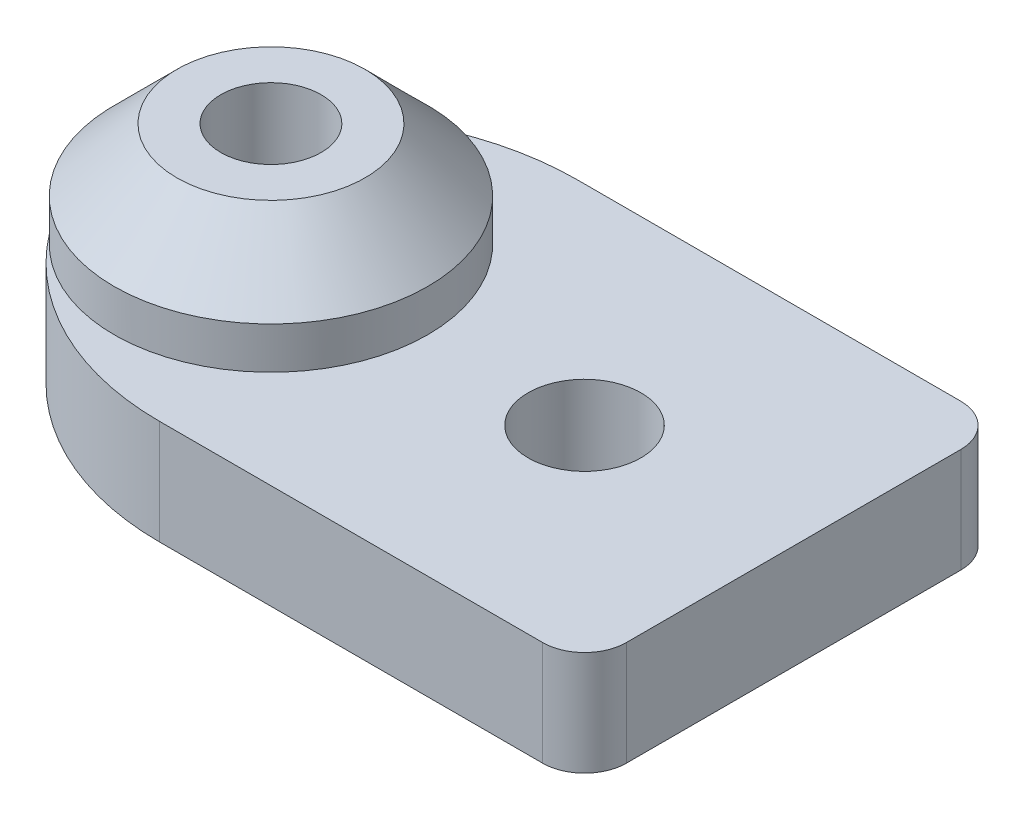
ISO-10303-21;
HEADER;
FILE_DESCRIPTION(('STEP AP214'),'2;1');
FILE_NAME('part.step','',(''),(''),'','','');
FILE_SCHEMA(('AUTOMOTIVE_DESIGN { 1 0 10303 214 1 1 1 1 }'));
ENDSEC;
DATA;
#1=APPLICATION_CONTEXT('core data for automotive mechanical design processes');
#2=APPLICATION_PROTOCOL_DEFINITION('international standard','automotive_design',2000,#1);
#3=PRODUCT_CONTEXT('',#1,'mechanical');
#4=PRODUCT('Part','Part','',(#3));
#5=PRODUCT_RELATED_PRODUCT_CATEGORY('part','',(#4));
#6=PRODUCT_DEFINITION_FORMATION('','',#4);
#7=PRODUCT_DEFINITION_CONTEXT('part definition',#1,'design');
#8=PRODUCT_DEFINITION('design','',#6,#7);
#9=PRODUCT_DEFINITION_SHAPE('','',#8);
#10=(LENGTH_UNIT() NAMED_UNIT(*) SI_UNIT(.MILLI.,.METRE.));
#11=(NAMED_UNIT(*) PLANE_ANGLE_UNIT() SI_UNIT($,.RADIAN.));
#12=(NAMED_UNIT(*) SI_UNIT($,.STERADIAN.) SOLID_ANGLE_UNIT());
#13=UNCERTAINTY_MEASURE_WITH_UNIT(LENGTH_MEASURE(1.E-05),#10,'distance_accuracy_value','');
#14=(GEOMETRIC_REPRESENTATION_CONTEXT(3) GLOBAL_UNCERTAINTY_ASSIGNED_CONTEXT((#13)) GLOBAL_UNIT_ASSIGNED_CONTEXT((#10,
#11,#12)) REPRESENTATION_CONTEXT('',''));
#15=CARTESIAN_POINT('',(0.,0.,0.));
#16=DIRECTION('',(0.,0.,1.));
#17=DIRECTION('',(1.,0.,0.));
#18=AXIS2_PLACEMENT_3D('',#15,#16,#17);
#19=CARTESIAN_POINT('',(4.66797600679352,5.,-13.108));
#20=DIRECTION('',(0.,1.,0.));
#21=DIRECTION('',(0.,0.,1.));
#22=AXIS2_PLACEMENT_3D('',#19,#20,#21);
#23=PLANE('',#22);
#24=DIRECTION('',(0.,0.,-1.));
#25=VECTOR('',#24,1.);
#26=CARTESIAN_POINT('',(25.,5.,0.));
#27=LINE('',#26,#25);
#28=CARTESIAN_POINT('',(25.,5.,-2.));
#29=VERTEX_POINT('',#28);
#30=CARTESIAN_POINT('',(25.,5.,-18.));
#31=VERTEX_POINT('',#30);
#32=EDGE_CURVE('E149',#29,#31,#27,.T.);
#33=ORIENTED_EDGE('',*,*,#32,.T.);
#34=CARTESIAN_POINT('',(23.,5.,-18.));
#35=DIRECTION('',(0.,1.,0.));
#36=DIRECTION('',(0.,0.,1.));
#37=AXIS2_PLACEMENT_3D('',#34,#35,#36);
#38=CIRCLE('',#37,2.);
#39=CARTESIAN_POINT('',(23.,5.,-20.));
#40=VERTEX_POINT('',#39);
#41=EDGE_CURVE('E41',#31,#40,#38,.T.);
#42=ORIENTED_EDGE('',*,*,#41,.T.);
#43=DIRECTION('',(-1.,0.,0.));
#44=VECTOR('',#43,1.);
#45=CARTESIAN_POINT('',(4.66797600679352,5.,-20.));
#46=LINE('',#45,#44);
#47=CARTESIAN_POINT('',(4.66797600679353,5.,-20.));
#48=VERTEX_POINT('',#47);
#49=EDGE_CURVE('E119',#40,#48,#46,.T.);
#50=ORIENTED_EDGE('',*,*,#49,.T.);
#51=CARTESIAN_POINT('',(4.66797600679352,5.,-6.892));
#52=DIRECTION('',(0.,1.,0.));
#53=DIRECTION('',(0.,0.,1.));
#54=AXIS2_PLACEMENT_3D('',#51,#52,#53);
#55=CIRCLE('',#54,13.108);
#56=CARTESIAN_POINT('',(-6.24283524446352,5.,-14.1565620542083));
#57=VERTEX_POINT('',#56);
#58=EDGE_CURVE('E104',#48,#57,#55,.T.);
#59=ORIENTED_EDGE('',*,*,#58,.T.);
#60=CARTESIAN_POINT('',(0.,5.,-10.));
#61=DIRECTION('',(0.,1.,0.));
#62=DIRECTION('',(0.,0.,1.));
#63=AXIS2_PLACEMENT_3D('',#60,#61,#62);
#64=CIRCLE('',#63,7.5);
#65=CARTESIAN_POINT('',(-6.24283524446352,5.,-5.84343794579173));
#66=VERTEX_POINT('',#65);
#67=EDGE_CURVE('E116',#66,#57,#64,.T.);
#68=ORIENTED_EDGE('',*,*,#67,.F.);
#69=CARTESIAN_POINT('',(4.66797600679352,5.,-13.108));
#70=DIRECTION('',(0.,1.,0.));
#71=DIRECTION('',(0.,0.,1.));
#72=AXIS2_PLACEMENT_3D('',#69,#70,#71);
#73=CIRCLE('',#72,13.108);
#74=CARTESIAN_POINT('',(4.66797600679352,5.,0.));
#75=VERTEX_POINT('',#74);
#76=EDGE_CURVE('E120',#66,#75,#73,.T.);
#77=ORIENTED_EDGE('',*,*,#76,.T.);
#78=DIRECTION('',(1.,0.,0.));
#79=VECTOR('',#78,1.);
#80=CARTESIAN_POINT('',(4.66797600679352,5.,0.));
#81=LINE('',#80,#79);
#82=CARTESIAN_POINT('',(23.,5.,0.));
#83=VERTEX_POINT('',#82);
#84=EDGE_CURVE('E147',#75,#83,#81,.T.);
#85=ORIENTED_EDGE('',*,*,#84,.T.);
#86=CARTESIAN_POINT('',(23.,5.,-2.));
#87=DIRECTION('',(0.,1.,0.));
#88=DIRECTION('',(0.,0.,1.));
#89=AXIS2_PLACEMENT_3D('',#86,#87,#88);
#90=CIRCLE('',#89,2.);
#91=EDGE_CURVE('E177',#83,#29,#90,.T.);
#92=ORIENTED_EDGE('',*,*,#91,.T.);
#93=EDGE_LOOP('',(#33,#42,#50,#59,#68,#77,#85,#92));
#94=FACE_BOUND('',#93,.T.);
#95=CARTESIAN_POINT('',(15.,5.,-10.));
#96=DIRECTION('',(0.,1.,0.));
#97=DIRECTION('',(0.,0.,1.));
#98=AXIS2_PLACEMENT_3D('',#95,#96,#97);
#99=CIRCLE('',#98,2.7);
#100=CARTESIAN_POINT('',(15.,5.,-7.3));
#101=VERTEX_POINT('',#100);
#102=EDGE_CURVE('E138',#101,#101,#99,.T.);
#103=ORIENTED_EDGE('',*,*,#102,.F.);
#104=EDGE_LOOP('',(#103));
#105=FACE_BOUND('',#104,.T.);
#106=ADVANCED_FACE('F33',(#94,#105),#23,.T.);
#107=CARTESIAN_POINT('',(4.66797600679352,0.,-13.108));
#108=DIRECTION('',(0.,1.,0.));
#109=DIRECTION('',(0.,0.,1.));
#110=AXIS2_PLACEMENT_3D('',#107,#108,#109);
#111=PLANE('',#110);
#112=DIRECTION('',(-1.,0.,0.));
#113=VECTOR('',#112,1.);
#114=CARTESIAN_POINT('',(4.66797600679352,0.,-20.));
#115=LINE('',#114,#113);
#116=CARTESIAN_POINT('',(23.,0.,-20.));
#117=VERTEX_POINT('',#116);
#118=CARTESIAN_POINT('',(4.66797600679353,0.,-20.));
#119=VERTEX_POINT('',#118);
#120=EDGE_CURVE('E141',#117,#119,#115,.T.);
#121=ORIENTED_EDGE('',*,*,#120,.F.);
#122=CARTESIAN_POINT('',(23.,0.,-18.));
#123=DIRECTION('',(0.,1.,0.));
#124=DIRECTION('',(0.,0.,1.));
#125=AXIS2_PLACEMENT_3D('',#122,#123,#124);
#126=CIRCLE('',#125,2.);
#127=CARTESIAN_POINT('',(25.,0.,-18.));
#128=VERTEX_POINT('',#127);
#129=EDGE_CURVE('E171',#117,#128,#126,.F.);
#130=ORIENTED_EDGE('',*,*,#129,.T.);
#131=DIRECTION('',(0.,0.,-1.));
#132=VECTOR('',#131,1.);
#133=CARTESIAN_POINT('',(25.,0.,0.));
#134=LINE('',#133,#132);
#135=CARTESIAN_POINT('',(25.,0.,-2.));
#136=VERTEX_POINT('',#135);
#137=EDGE_CURVE('E144',#136,#128,#134,.T.);
#138=ORIENTED_EDGE('',*,*,#137,.F.);
#139=CARTESIAN_POINT('',(23.,0.,-2.));
#140=DIRECTION('',(0.,1.,0.));
#141=DIRECTION('',(0.,0.,1.));
#142=AXIS2_PLACEMENT_3D('',#139,#140,#141);
#143=CIRCLE('',#142,2.);
#144=CARTESIAN_POINT('',(23.,0.,0.));
#145=VERTEX_POINT('',#144);
#146=EDGE_CURVE('E169',#136,#145,#143,.F.);
#147=ORIENTED_EDGE('',*,*,#146,.T.);
#148=DIRECTION('',(1.,0.,0.));
#149=VECTOR('',#148,1.);
#150=CARTESIAN_POINT('',(4.66797600679352,0.,0.));
#151=LINE('',#150,#149);
#152=CARTESIAN_POINT('',(4.66797600679352,0.,0.));
#153=VERTEX_POINT('',#152);
#154=EDGE_CURVE('E158',#153,#145,#151,.T.);
#155=ORIENTED_EDGE('',*,*,#154,.F.);
#156=CARTESIAN_POINT('',(4.66797600679352,0.,-13.108));
#157=DIRECTION('',(0.,1.,0.));
#158=DIRECTION('',(0.,0.,1.));
#159=AXIS2_PLACEMENT_3D('',#156,#157,#158);
#160=CIRCLE('',#159,13.108);
#161=CARTESIAN_POINT('',(-6.24283524446352,0.,-5.84343794579173));
#162=VERTEX_POINT('',#161);
#163=EDGE_CURVE('E156',#162,#153,#160,.T.);
#164=ORIENTED_EDGE('',*,*,#163,.F.);
#165=CARTESIAN_POINT('',(0.,0.,-10.));
#166=DIRECTION('',(0.,1.,0.));
#167=DIRECTION('',(0.,0.,1.));
#168=AXIS2_PLACEMENT_3D('',#165,#166,#167);
#169=CIRCLE('',#168,7.5);
#170=CARTESIAN_POINT('',(-6.24283524446352,0.,-14.1565620542083));
#171=VERTEX_POINT('',#170);
#172=EDGE_CURVE('E154',#171,#162,#169,.T.);
#173=ORIENTED_EDGE('',*,*,#172,.F.);
#174=CARTESIAN_POINT('',(4.66797600679352,0.,-6.892));
#175=DIRECTION('',(0.,1.,0.));
#176=DIRECTION('',(0.,0.,1.));
#177=AXIS2_PLACEMENT_3D('',#174,#175,#176);
#178=CIRCLE('',#177,13.108);
#179=EDGE_CURVE('E107',#119,#171,#178,.T.);
#180=ORIENTED_EDGE('',*,*,#179,.F.);
#181=EDGE_LOOP('',(#121,#130,#138,#147,#155,#164,#173,#180));
#182=FACE_BOUND('',#181,.T.);
#183=CARTESIAN_POINT('',(15.,0.,-10.));
#184=DIRECTION('',(0.,1.,0.));
#185=DIRECTION('',(0.,0.,1.));
#186=AXIS2_PLACEMENT_3D('',#183,#184,#185);
#187=CIRCLE('',#186,2.7);
#188=CARTESIAN_POINT('',(15.,0.,-7.3));
#189=VERTEX_POINT('',#188);
#190=EDGE_CURVE('E137',#189,#189,#187,.T.);
#191=ORIENTED_EDGE('',*,*,#190,.T.);
#192=EDGE_LOOP('',(#191));
#193=FACE_BOUND('',#192,.T.);
#194=CARTESIAN_POINT('',(0.,0.,-10.));
#195=DIRECTION('',(0.,1.,0.));
#196=DIRECTION('',(0.,0.,1.));
#197=AXIS2_PLACEMENT_3D('',#194,#195,#196);
#198=CIRCLE('',#197,2.4);
#199=CARTESIAN_POINT('',(0.,0.,-7.6));
#200=VERTEX_POINT('',#199);
#201=EDGE_CURVE('E134',#200,#200,#198,.T.);
#202=ORIENTED_EDGE('',*,*,#201,.T.);
#203=EDGE_LOOP('',(#202));
#204=FACE_BOUND('',#203,.T.);
#205=ADVANCED_FACE('F187',(#182,#193,#204),#111,.F.);
#206=CARTESIAN_POINT('',(4.66797600679352,5.,-20.));
#207=DIRECTION('',(0.,0.,1.));
#208=DIRECTION('',(1.,0.,0.));
#209=AXIS2_PLACEMENT_3D('',#206,#207,#208);
#210=PLANE('',#209);
#211=ORIENTED_EDGE('',*,*,#49,.F.);
#212=DIRECTION('',(0.,-1.,0.));
#213=VECTOR('',#212,1.);
#214=CARTESIAN_POINT('',(23.,5.,-20.));
#215=LINE('',#214,#213);
#216=EDGE_CURVE('E166',#40,#117,#215,.T.);
#217=ORIENTED_EDGE('',*,*,#216,.T.);
#218=ORIENTED_EDGE('',*,*,#120,.T.);
#219=DIRECTION('',(0.,-1.,0.));
#220=VECTOR('',#219,1.);
#221=CARTESIAN_POINT('',(4.66797600679353,5.,-20.));
#222=LINE('',#221,#220);
#223=EDGE_CURVE('E111',#48,#119,#222,.T.);
#224=ORIENTED_EDGE('',*,*,#223,.F.);
#225=EDGE_LOOP('',(#211,#217,#218,#224));
#226=FACE_BOUND('',#225,.T.);
#227=ADVANCED_FACE('F182',(#226),#210,.F.);
#228=CARTESIAN_POINT('',(4.66797600679352,5.,-6.892));
#229=DIRECTION('',(0.,-1.,0.));
#230=DIRECTION('',(0.,0.,-1.));
#231=AXIS2_PLACEMENT_3D('',#228,#229,#230);
#232=CYLINDRICAL_SURFACE('',#231,13.108);
#233=ORIENTED_EDGE('',*,*,#179,.T.);
#234=DIRECTION('',(0.,-1.,0.));
#235=VECTOR('',#234,1.);
#236=CARTESIAN_POINT('',(-6.24283524446352,5.,-14.1565620542083));
#237=LINE('',#236,#235);
#238=EDGE_CURVE('E100',#57,#171,#237,.T.);
#239=ORIENTED_EDGE('',*,*,#238,.F.);
#240=ORIENTED_EDGE('',*,*,#58,.F.);
#241=ORIENTED_EDGE('',*,*,#223,.T.);
#242=EDGE_LOOP('',(#233,#239,#240,#241));
#243=FACE_BOUND('',#242,.T.);
#244=ADVANCED_FACE('F102',(#243),#232,.T.);
#245=CARTESIAN_POINT('',(0.,5.,-10.));
#246=DIRECTION('',(0.,-1.,0.));
#247=DIRECTION('',(0.,0.,-1.));
#248=AXIS2_PLACEMENT_3D('',#245,#246,#247);
#249=CYLINDRICAL_SURFACE('',#248,7.5);
#250=CARTESIAN_POINT('',(0.,6.99999999999998,-10.));
#251=DIRECTION('',(0.,1.,0.));
#252=DIRECTION('',(0.,0.,1.));
#253=AXIS2_PLACEMENT_3D('',#250,#251,#252);
#254=CIRCLE('',#253,7.5);
#255=CARTESIAN_POINT('',(0.,6.99999999999998,-2.5));
#256=VERTEX_POINT('',#255);
#257=EDGE_CURVE('E128',#256,#256,#254,.F.);
#258=ORIENTED_EDGE('',*,*,#257,.T.);
#259=EDGE_LOOP('',(#258));
#260=FACE_BOUND('',#259,.T.);
#261=ORIENTED_EDGE('',*,*,#172,.T.);
#262=DIRECTION('',(0.,-1.,0.));
#263=VECTOR('',#262,1.);
#264=CARTESIAN_POINT('',(-6.24283524446352,5.,-5.84343794579173));
#265=LINE('',#264,#263);
#266=EDGE_CURVE('E112',#66,#162,#265,.T.);
#267=ORIENTED_EDGE('',*,*,#266,.F.);
#268=ORIENTED_EDGE('',*,*,#67,.T.);
#269=ORIENTED_EDGE('',*,*,#238,.T.);
#270=EDGE_LOOP('',(#261,#267,#268,#269));
#271=FACE_BOUND('',#270,.T.);
#272=ADVANCED_FACE('F122',(#260,#271),#249,.T.);
#273=CARTESIAN_POINT('',(4.66797600679352,5.,-13.108));
#274=DIRECTION('',(0.,-1.,0.));
#275=DIRECTION('',(0.,0.,-1.));
#276=AXIS2_PLACEMENT_3D('',#273,#274,#275);
#277=CYLINDRICAL_SURFACE('',#276,13.108);
#278=ORIENTED_EDGE('',*,*,#163,.T.);
#279=DIRECTION('',(0.,-1.,0.));
#280=VECTOR('',#279,1.);
#281=CARTESIAN_POINT('',(4.66797600679352,5.,0.));
#282=LINE('',#281,#280);
#283=EDGE_CURVE('E151',#75,#153,#282,.T.);
#284=ORIENTED_EDGE('',*,*,#283,.F.);
#285=ORIENTED_EDGE('',*,*,#76,.F.);
#286=ORIENTED_EDGE('',*,*,#266,.T.);
#287=EDGE_LOOP('',(#278,#284,#285,#286));
#288=FACE_BOUND('',#287,.T.);
#289=ADVANCED_FACE('F198',(#288),#277,.T.);
#290=CARTESIAN_POINT('',(4.66797600679352,5.,0.));
#291=DIRECTION('',(0.,0.,-1.));
#292=DIRECTION('',(-1.,0.,0.));
#293=AXIS2_PLACEMENT_3D('',#290,#291,#292);
#294=PLANE('',#293);
#295=ORIENTED_EDGE('',*,*,#154,.T.);
#296=DIRECTION('',(0.,-1.,0.));
#297=VECTOR('',#296,1.);
#298=CARTESIAN_POINT('',(23.,5.,0.));
#299=LINE('',#298,#297);
#300=EDGE_CURVE('E11',#145,#83,#299,.F.);
#301=ORIENTED_EDGE('',*,*,#300,.T.);
#302=ORIENTED_EDGE('',*,*,#84,.F.);
#303=ORIENTED_EDGE('',*,*,#283,.T.);
#304=EDGE_LOOP('',(#295,#301,#302,#303));
#305=FACE_BOUND('',#304,.T.);
#306=ADVANCED_FACE('F195',(#305),#294,.F.);
#307=CARTESIAN_POINT('',(25.,5.,0.));
#308=DIRECTION('',(-1.,0.,0.));
#309=DIRECTION('',(0.,0.,1.));
#310=AXIS2_PLACEMENT_3D('',#307,#308,#309);
#311=PLANE('',#310);
#312=ORIENTED_EDGE('',*,*,#137,.T.);
#313=DIRECTION('',(0.,-1.,0.));
#314=VECTOR('',#313,1.);
#315=CARTESIAN_POINT('',(25.,5.,-18.));
#316=LINE('',#315,#314);
#317=EDGE_CURVE('E54',#128,#31,#316,.F.);
#318=ORIENTED_EDGE('',*,*,#317,.T.);
#319=ORIENTED_EDGE('',*,*,#32,.F.);
#320=DIRECTION('',(0.,-1.,0.));
#321=VECTOR('',#320,1.);
#322=CARTESIAN_POINT('',(25.,5.,-2.));
#323=LINE('',#322,#321);
#324=EDGE_CURVE('E173',#29,#136,#323,.T.);
#325=ORIENTED_EDGE('',*,*,#324,.T.);
#326=EDGE_LOOP('',(#312,#318,#319,#325));
#327=FACE_BOUND('',#326,.T.);
#328=ADVANCED_FACE('F189',(#327),#311,.F.);
#329=CARTESIAN_POINT('',(15.,5.,-10.));
#330=DIRECTION('',(0.,-1.,0.));
#331=DIRECTION('',(0.,0.,-1.));
#332=AXIS2_PLACEMENT_3D('',#329,#330,#331);
#333=CYLINDRICAL_SURFACE('',#332,2.7);
#334=ORIENTED_EDGE('',*,*,#102,.T.);
#335=EDGE_LOOP('',(#334));
#336=FACE_BOUND('',#335,.T.);
#337=ORIENTED_EDGE('',*,*,#190,.F.);
#338=EDGE_LOOP('',(#337));
#339=FACE_BOUND('',#338,.T.);
#340=ADVANCED_FACE('F215',(#336,#339),#333,.F.);
#341=CARTESIAN_POINT('',(0.,5.,-10.));
#342=DIRECTION('',(0.,-1.,0.));
#343=DIRECTION('',(0.,0.,-1.));
#344=AXIS2_PLACEMENT_3D('',#341,#342,#343);
#345=CYLINDRICAL_SURFACE('',#344,2.4);
#346=ORIENTED_EDGE('',*,*,#201,.F.);
#347=EDGE_LOOP('',(#346));
#348=FACE_BOUND('',#347,.T.);
#349=CARTESIAN_POINT('',(0.,10.,-10.));
#350=DIRECTION('',(0.,1.,0.));
#351=DIRECTION('',(0.,0.,1.));
#352=AXIS2_PLACEMENT_3D('',#349,#350,#351);
#353=CIRCLE('',#352,2.4);
#354=CARTESIAN_POINT('',(0.,10.,-7.6));
#355=VERTEX_POINT('',#354);
#356=EDGE_CURVE('E133',#355,#355,#353,.T.);
#357=ORIENTED_EDGE('',*,*,#356,.T.);
#358=EDGE_LOOP('',(#357));
#359=FACE_BOUND('',#358,.T.);
#360=ADVANCED_FACE('F222',(#348,#359),#345,.F.);
#361=CARTESIAN_POINT('',(0.,10.,-10.));
#362=DIRECTION('',(0.,1.,0.));
#363=DIRECTION('',(0.,0.,1.));
#364=AXIS2_PLACEMENT_3D('',#361,#362,#363);
#365=PLANE('',#364);
#366=CARTESIAN_POINT('',(0.,10.,-10.));
#367=DIRECTION('',(0.,1.,0.));
#368=DIRECTION('',(0.,0.,1.));
#369=AXIS2_PLACEMENT_3D('',#366,#367,#368);
#370=CIRCLE('',#369,4.49999999999999);
#371=CARTESIAN_POINT('',(0.,10.,-5.50000000000001));
#372=VERTEX_POINT('',#371);
#373=EDGE_CURVE('E125',#372,#372,#370,.T.);
#374=ORIENTED_EDGE('',*,*,#373,.T.);
#375=EDGE_LOOP('',(#374));
#376=FACE_BOUND('',#375,.T.);
#377=ORIENTED_EDGE('',*,*,#356,.F.);
#378=EDGE_LOOP('',(#377));
#379=FACE_BOUND('',#378,.T.);
#380=ADVANCED_FACE('F227',(#376,#379),#365,.T.);
#381=CARTESIAN_POINT('',(0.,10.,-10.));
#382=DIRECTION('',(0.,-1.,0.));
#383=DIRECTION('',(0.,0.,-1.));
#384=AXIS2_PLACEMENT_3D('',#381,#382,#383);
#385=CONICAL_SURFACE('',#384,4.49999999999999,0.785398163397447);
#386=ORIENTED_EDGE('',*,*,#257,.F.);
#387=EDGE_LOOP('',(#386));
#388=FACE_BOUND('',#387,.T.);
#389=ORIENTED_EDGE('',*,*,#373,.F.);
#390=EDGE_LOOP('',(#389));
#391=FACE_BOUND('',#390,.T.);
#392=ADVANCED_FACE('F239',(#388,#391),#385,.T.);
#393=CARTESIAN_POINT('',(23.,5.,-18.));
#394=DIRECTION('',(0.,-1.,0.));
#395=DIRECTION('',(0.,0.,-1.));
#396=AXIS2_PLACEMENT_3D('',#393,#394,#395);
#397=CYLINDRICAL_SURFACE('',#396,2.);
#398=ORIENTED_EDGE('',*,*,#41,.F.);
#399=ORIENTED_EDGE('',*,*,#317,.F.);
#400=ORIENTED_EDGE('',*,*,#129,.F.);
#401=ORIENTED_EDGE('',*,*,#216,.F.);
#402=EDGE_LOOP('',(#398,#399,#400,#401));
#403=FACE_BOUND('',#402,.T.);
#404=ADVANCED_FACE('F184',(#403),#397,.T.);
#405=CARTESIAN_POINT('',(23.,5.,-2.));
#406=DIRECTION('',(0.,-1.,0.));
#407=DIRECTION('',(0.,0.,-1.));
#408=AXIS2_PLACEMENT_3D('',#405,#406,#407);
#409=CYLINDRICAL_SURFACE('',#408,2.);
#410=ORIENTED_EDGE('',*,*,#91,.F.);
#411=ORIENTED_EDGE('',*,*,#300,.F.);
#412=ORIENTED_EDGE('',*,*,#146,.F.);
#413=ORIENTED_EDGE('',*,*,#324,.F.);
#414=EDGE_LOOP('',(#410,#411,#412,#413));
#415=FACE_BOUND('',#414,.T.);
#416=ADVANCED_FACE('F35',(#415),#409,.T.);
#417=CLOSED_SHELL('',(#106,#205,#227,#244,#272,#289,#306,#328,#340,#360,#380,#392,#404,#416));
#418=MANIFOLD_SOLID_BREP('B2',#417);
#419=ADVANCED_BREP_SHAPE_REPRESENTATION('',(#18,#418),#14);
#420=SHAPE_DEFINITION_REPRESENTATION(#9,#419);
ENDSEC;
END-ISO-10303-21;
